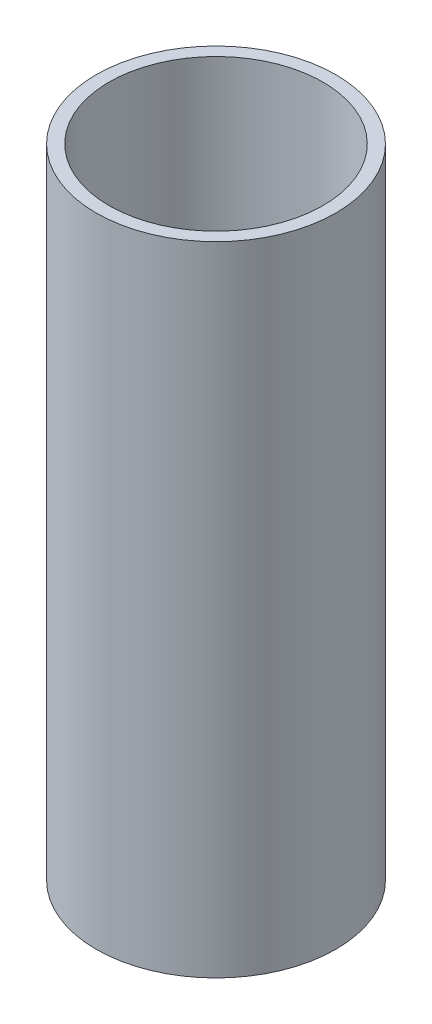
ISO-10303-21;
HEADER;
FILE_DESCRIPTION(('STEP AP214'),'2;1');
FILE_NAME('part.step','',(''),(''),'','','');
FILE_SCHEMA(('AUTOMOTIVE_DESIGN { 1 0 10303 214 1 1 1 1 }'));
ENDSEC;
DATA;
#1=APPLICATION_CONTEXT('core data for automotive mechanical design processes');
#2=APPLICATION_PROTOCOL_DEFINITION('international standard','automotive_design',2000,#1);
#3=PRODUCT_CONTEXT('',#1,'mechanical');
#4=PRODUCT('Part','Part','',(#3));
#5=PRODUCT_RELATED_PRODUCT_CATEGORY('part','',(#4));
#6=PRODUCT_DEFINITION_FORMATION('','',#4);
#7=PRODUCT_DEFINITION_CONTEXT('part definition',#1,'design');
#8=PRODUCT_DEFINITION('design','',#6,#7);
#9=PRODUCT_DEFINITION_SHAPE('','',#8);
#10=(LENGTH_UNIT() NAMED_UNIT(*) SI_UNIT(.MILLI.,.METRE.));
#11=(NAMED_UNIT(*) PLANE_ANGLE_UNIT() SI_UNIT($,.RADIAN.));
#12=(NAMED_UNIT(*) SI_UNIT($,.STERADIAN.) SOLID_ANGLE_UNIT());
#13=UNCERTAINTY_MEASURE_WITH_UNIT(LENGTH_MEASURE(1.E-05),#10,'distance_accuracy_value','');
#14=(GEOMETRIC_REPRESENTATION_CONTEXT(3) GLOBAL_UNCERTAINTY_ASSIGNED_CONTEXT((#13)) GLOBAL_UNIT_ASSIGNED_CONTEXT((#10,
#11,#12)) REPRESENTATION_CONTEXT('',''));
#15=CARTESIAN_POINT('',(0.,0.,0.));
#16=DIRECTION('',(0.,0.,1.));
#17=DIRECTION('',(1.,0.,0.));
#18=AXIS2_PLACEMENT_3D('',#15,#16,#17);
#19=CARTESIAN_POINT('',(0.,55.8735,0.));
#20=DIRECTION('',(0.,1.,0.));
#21=DIRECTION('',(0.,0.,1.));
#22=AXIS2_PLACEMENT_3D('',#19,#20,#21);
#23=PLANE('',#22);
#24=CARTESIAN_POINT('',(0.,55.8735,0.));
#25=DIRECTION('',(0.,1.,0.));
#26=DIRECTION('',(0.,0.,1.));
#27=AXIS2_PLACEMENT_3D('',#24,#25,#26);
#28=CIRCLE('',#27,7.00000000000001);
#29=CARTESIAN_POINT('',(0.,55.8735,7.00000000000001));
#30=VERTEX_POINT('',#29);
#31=EDGE_CURVE('E10',#30,#30,#28,.T.);
#32=ORIENTED_EDGE('',*,*,#31,.T.);
#33=EDGE_LOOP('',(#32));
#34=FACE_BOUND('',#33,.T.);
#35=CARTESIAN_POINT('',(0.,55.8735,0.));
#36=DIRECTION('',(0.,1.,0.));
#37=DIRECTION('',(0.,0.,1.));
#38=AXIS2_PLACEMENT_3D('',#35,#36,#37);
#39=CIRCLE('',#38,6.25);
#40=CARTESIAN_POINT('',(0.,55.8735,6.25));
#41=VERTEX_POINT('',#40);
#42=EDGE_CURVE('E44',#41,#41,#39,.T.);
#43=ORIENTED_EDGE('',*,*,#42,.F.);
#44=EDGE_LOOP('',(#43));
#45=FACE_BOUND('',#44,.T.);
#46=ADVANCED_FACE('F33',(#34,#45),#23,.T.);
#47=CARTESIAN_POINT('',(0.,18.6245,0.));
#48=DIRECTION('',(0.,1.,0.));
#49=DIRECTION('',(0.,0.,1.));
#50=AXIS2_PLACEMENT_3D('',#47,#48,#49);
#51=PLANE('',#50);
#52=CARTESIAN_POINT('',(0.,18.6245,0.));
#53=DIRECTION('',(0.,1.,0.));
#54=DIRECTION('',(0.,0.,1.));
#55=AXIS2_PLACEMENT_3D('',#52,#53,#54);
#56=CIRCLE('',#55,7.00000000000001);
#57=CARTESIAN_POINT('',(0.,18.6245,7.00000000000001));
#58=VERTEX_POINT('',#57);
#59=EDGE_CURVE('E37',#58,#58,#56,.T.);
#60=ORIENTED_EDGE('',*,*,#59,.F.);
#61=EDGE_LOOP('',(#60));
#62=FACE_BOUND('',#61,.T.);
#63=CARTESIAN_POINT('',(0.,18.6245,0.));
#64=DIRECTION('',(0.,1.,0.));
#65=DIRECTION('',(0.,0.,1.));
#66=AXIS2_PLACEMENT_3D('',#63,#64,#65);
#67=CIRCLE('',#66,6.25);
#68=CARTESIAN_POINT('',(0.,18.6245,6.25));
#69=VERTEX_POINT('',#68);
#70=EDGE_CURVE('E46',#69,#69,#67,.T.);
#71=ORIENTED_EDGE('',*,*,#70,.T.);
#72=EDGE_LOOP('',(#71));
#73=FACE_BOUND('',#72,.T.);
#74=ADVANCED_FACE('F56',(#62,#73),#51,.F.);
#75=CARTESIAN_POINT('',(0.,55.8735,0.));
#76=DIRECTION('',(0.,-1.,0.));
#77=DIRECTION('',(0.,0.,-1.));
#78=AXIS2_PLACEMENT_3D('',#75,#76,#77);
#79=CYLINDRICAL_SURFACE('',#78,7.00000000000001);
#80=ORIENTED_EDGE('',*,*,#31,.F.);
#81=EDGE_LOOP('',(#80));
#82=FACE_BOUND('',#81,.T.);
#83=ORIENTED_EDGE('',*,*,#59,.T.);
#84=EDGE_LOOP('',(#83));
#85=FACE_BOUND('',#84,.T.);
#86=ADVANCED_FACE('F35',(#82,#85),#79,.T.);
#87=CARTESIAN_POINT('',(0.,55.8735,0.));
#88=DIRECTION('',(0.,-1.,0.));
#89=DIRECTION('',(0.,0.,-1.));
#90=AXIS2_PLACEMENT_3D('',#87,#88,#89);
#91=CYLINDRICAL_SURFACE('',#90,6.25);
#92=ORIENTED_EDGE('',*,*,#42,.T.);
#93=EDGE_LOOP('',(#92));
#94=FACE_BOUND('',#93,.T.);
#95=ORIENTED_EDGE('',*,*,#70,.F.);
#96=EDGE_LOOP('',(#95));
#97=FACE_BOUND('',#96,.T.);
#98=ADVANCED_FACE('F52',(#94,#97),#91,.F.);
#99=CLOSED_SHELL('',(#46,#74,#86,#98));
#100=MANIFOLD_SOLID_BREP('B2',#99);
#101=ADVANCED_BREP_SHAPE_REPRESENTATION('',(#18,#100),#14);
#102=SHAPE_DEFINITION_REPRESENTATION(#9,#101);
ENDSEC;
END-ISO-10303-21;
